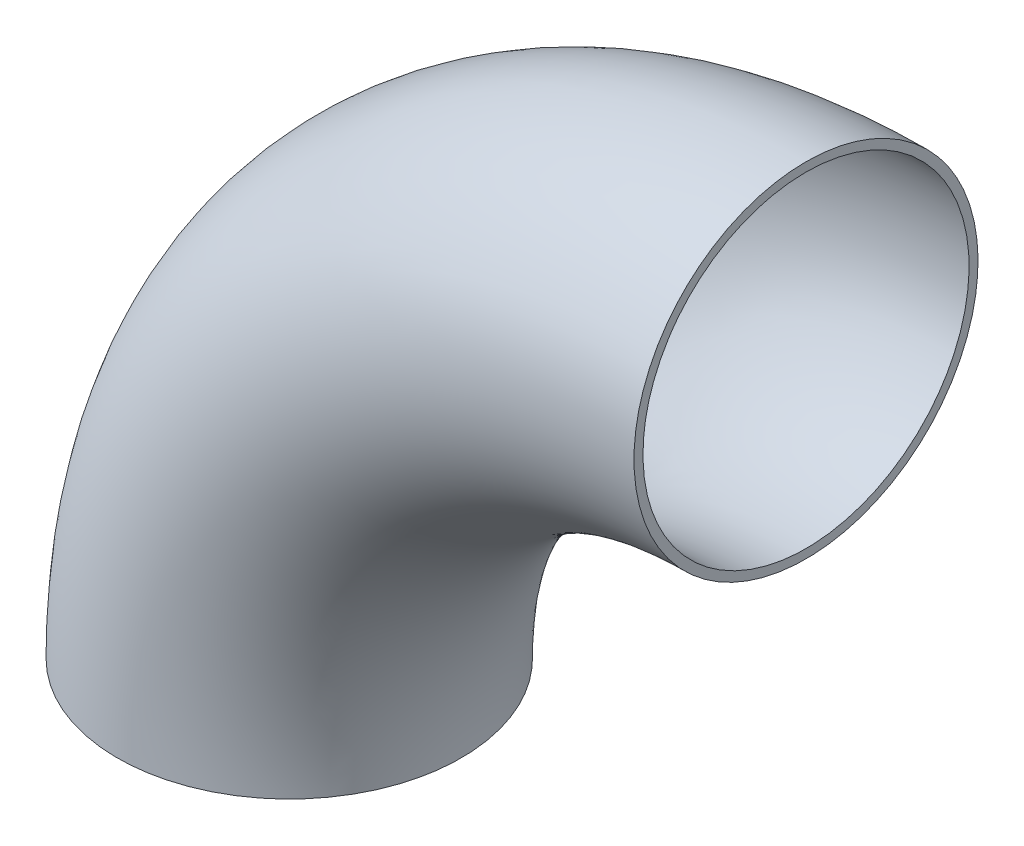
ISO-10303-21;
HEADER;
FILE_DESCRIPTION(('STEP AP214'),'2;1');
FILE_NAME('part.step','',(''),(''),'','','');
FILE_SCHEMA(('AUTOMOTIVE_DESIGN { 1 0 10303 214 1 1 1 1 }'));
ENDSEC;
DATA;
#1=APPLICATION_CONTEXT('core data for automotive mechanical design processes');
#2=APPLICATION_PROTOCOL_DEFINITION('international standard','automotive_design',2000,#1);
#3=PRODUCT_CONTEXT('',#1,'mechanical');
#4=PRODUCT('Part','Part','',(#3));
#5=PRODUCT_RELATED_PRODUCT_CATEGORY('part','',(#4));
#6=PRODUCT_DEFINITION_FORMATION('','',#4);
#7=PRODUCT_DEFINITION_CONTEXT('part definition',#1,'design');
#8=PRODUCT_DEFINITION('design','',#6,#7);
#9=PRODUCT_DEFINITION_SHAPE('','',#8);
#10=(LENGTH_UNIT() NAMED_UNIT(*) SI_UNIT(.MILLI.,.METRE.));
#11=(NAMED_UNIT(*) PLANE_ANGLE_UNIT() SI_UNIT($,.RADIAN.));
#12=(NAMED_UNIT(*) SI_UNIT($,.STERADIAN.) SOLID_ANGLE_UNIT());
#13=UNCERTAINTY_MEASURE_WITH_UNIT(LENGTH_MEASURE(1.E-05),#10,'distance_accuracy_value','');
#14=(GEOMETRIC_REPRESENTATION_CONTEXT(3) GLOBAL_UNCERTAINTY_ASSIGNED_CONTEXT((#13)) GLOBAL_UNIT_ASSIGNED_CONTEXT((#10,
#11,#12)) REPRESENTATION_CONTEXT('',''));
#15=CARTESIAN_POINT('',(0.,0.,0.));
#16=DIRECTION('',(0.,0.,1.));
#17=DIRECTION('',(1.,0.,0.));
#18=AXIS2_PLACEMENT_3D('',#15,#16,#17);
#19=CARTESIAN_POINT('',(95.377,0.,0.));
#20=DIRECTION('',(0.,0.,-1.));
#21=DIRECTION('',(-1.,0.,0.));
#22=AXIS2_PLACEMENT_3D('',#19,#20,#21);
#23=TOROIDAL_SURFACE('',#22,95.377,30.099);
#24=CARTESIAN_POINT('',(-30.099,0.,0.));
#25=CARTESIAN_POINT('',(-30.0990060673075,0.,0.845641403109949));
#26=CARTESIAN_POINT('',(-30.0633474836015,0.,1.69118323410832));
#27=CARTESIAN_POINT('',(-29.9209620799247,0.,3.37653914821918));
#28=CARTESIAN_POINT('',(-29.8142165635692,0.,4.21635166576193));
#29=CARTESIAN_POINT('',(-29.5302321212666,0.,5.8849163396915));
#30=CARTESIAN_POINT('',(-29.352915220142,0.,6.71365521027753));
#31=CARTESIAN_POINT('',(-28.929067561704,0.,8.35318543475601));
#32=CARTESIAN_POINT('',(-28.6825414016567,0.,9.163977976886));
#33=CARTESIAN_POINT('',(-28.1221515688635,0.,10.761534831184));
#34=CARTESIAN_POINT('',(-27.8083184360656,0.,11.548309856747));
#35=CARTESIAN_POINT('',(-27.1154750344904,0.,13.0926340132389));
#36=CARTESIAN_POINT('',(-26.7364637365509,0.,13.8501826824529));
#37=CARTESIAN_POINT('',(-25.9160673834376,0.,15.3304645122988));
#38=CARTESIAN_POINT('',(-25.4746982498269,0.,16.0532064970089));
#39=CARTESIAN_POINT('',(-24.5326523675352,0.,17.4589418708925));
#40=CARTESIAN_POINT('',(-24.0319758508865,0.,18.141935415561));
#41=CARTESIAN_POINT('',(-22.9748162047266,0.,19.4633927261855));
#42=CARTESIAN_POINT('',(-22.418327149911,0.,20.101851751936));
#43=CARTESIAN_POINT('',(-21.2535423683778,0.,21.3296219942096));
#44=CARTESIAN_POINT('',(-20.6452465891595,0.,21.9189331609254));
#45=CARTESIAN_POINT('',(-19.3811486487259,0.,23.0442394168817));
#46=CARTESIAN_POINT('',(-18.7253446393836,0.,23.5802324300553));
#47=CARTESIAN_POINT('',(-17.3709138613865,0.,24.5950654542918));
#48=CARTESIAN_POINT('',(-16.6722871011157,0.,25.0739054765443));
#49=CARTESIAN_POINT('',(-15.2371910511596,0.,25.9710199132504));
#50=CARTESIAN_POINT('',(-14.5007224644072,0.,26.3892954521722));
#51=CARTESIAN_POINT('',(-12.9951666757839,0.,27.1623178231562));
#52=CARTESIAN_POINT('',(-12.2260794733118,0.,27.5170646540475));
#53=CARTESIAN_POINT('',(-10.6607558153305,0.,28.1605069028242));
#54=CARTESIAN_POINT('',(-9.86451941474828,0.,28.4492024543324));
#55=CARTESIAN_POINT('',(-8.25055663788379,0.,28.9584906155634));
#56=CARTESIAN_POINT('',(-7.43283026162631,0.,29.1790832253647));
#57=CARTESIAN_POINT('',(-5.78169948703351,0.,29.5505975801853));
#58=CARTESIAN_POINT('',(-4.94829505874869,0.,29.7015191920992));
#59=CARTESIAN_POINT('',(-3.27173471578576,0.,29.9326179652855));
#60=CARTESIAN_POINT('',(-2.42857880111045,0.,30.0127951265783));
#61=CARTESIAN_POINT('',(-0.738511355559934,0.,30.1018349058816));
#62=CARTESIAN_POINT('',(0.108400168536035,0.,30.1106976525693));
#63=CARTESIAN_POINT('',(1.79995932215009,0.,30.0570459319653));
#64=CARTESIAN_POINT('',(2.64460695167093,0.,29.9945314647601));
#65=CARTESIAN_POINT('',(4.32563370356583,0.,29.798569719307));
#66=CARTESIAN_POINT('',(5.16201282284936,0.,29.6651224145474));
#67=CARTESIAN_POINT('',(6.82055608634279,0.,29.3282437068773));
#68=CARTESIAN_POINT('',(7.64272023053387,0.,29.1248123038741));
#69=CARTESIAN_POINT('',(9.26698931362081,0.,28.6494114220431));
#70=CARTESIAN_POINT('',(10.0690942313217,0.,28.3774418707999));
#71=CARTESIAN_POINT('',(11.6475414688685,0.,27.7668983414176));
#72=CARTESIAN_POINT('',(12.4238837887012,0.,27.4283243632443));
#73=CARTESIAN_POINT('',(13.9452862475613,0.,26.6869791617169));
#74=CARTESIAN_POINT('',(14.6903463967832,0.,26.2842079592843));
#75=CARTESIAN_POINT('',(16.1438878491115,0.,25.4173316935084));
#76=CARTESIAN_POINT('',(16.8523691522445,0.,24.9532266302099));
#77=CARTESIAN_POINT('',(18.2277157544082,0.,23.9669823528069));
#78=CARTESIAN_POINT('',(18.8945810702959,0.,23.4448431622099));
#79=CARTESIAN_POINT('',(20.1819549996112,0.,22.3462425726496));
#80=CARTESIAN_POINT('',(20.8024636130441,0.,21.7697811736926));
#81=CARTESIAN_POINT('',(21.9927127765104,0.,20.5666343782517));
#82=CARTESIAN_POINT('',(22.5624533195774,0.,19.9399489748762));
#83=CARTESIAN_POINT('',(23.6471157333723,0.,18.6408095964722));
#84=CARTESIAN_POINT('',(24.1620376040865,0.,17.9683556214322));
#85=CARTESIAN_POINT('',(25.1334019511084,0.,16.5824597533189));
#86=CARTESIAN_POINT('',(25.5898444197686,0.,15.8690178548855));
#87=CARTESIAN_POINT('',(26.4410048508892,0.,14.4062183650698));
#88=CARTESIAN_POINT('',(26.8357228133475,0.,13.6568607736863));
#89=CARTESIAN_POINT('',(27.5606280079282,0.,12.127557414993));
#90=CARTESIAN_POINT('',(27.890815242817,0.,11.3476116489946));
#91=CARTESIAN_POINT('',(28.4843115698094,0.,9.76267685827808));
#92=CARTESIAN_POINT('',(28.7476206619183,0.,8.95768783356196));
#93=CARTESIAN_POINT('',(29.2054887230813,0.,7.32838955205376));
#94=CARTESIAN_POINT('',(29.4000476952347,0.,6.50408029613263));
#95=CARTESIAN_POINT('',(29.7190323353591,0.,4.84200186187454));
#96=CARTESIAN_POINT('',(29.843458003332,0.,4.00423268353794));
#97=CARTESIAN_POINT('',(30.0212914431871,0.,2.3211904410831));
#98=CARTESIAN_POINT('',(30.0746992150693,0.,1.47591737696485));
#99=CARTESIAN_POINT('',(30.1101171655049,0.,-0.216123252289674));
#100=CARTESIAN_POINT('',(30.0921273440565,0.,-1.06289081742599));
#101=CARTESIAN_POINT('',(29.9848780022466,0.,-2.75190047703131));
#102=CARTESIAN_POINT('',(29.8956184786723,0.,-3.59414257129632));
#103=CARTESIAN_POINT('',(29.646464310356,0.,-5.26811341375078));
#104=CARTESIAN_POINT('',(29.4865696656083,0.,-6.09984216193942));
#105=CARTESIAN_POINT('',(29.0972820017657,0.,-7.74687325418405));
#106=CARTESIAN_POINT('',(28.8678889796913,0.,-8.56217559753582));
#107=CARTESIAN_POINT('',(28.3412354107381,0.,-10.170557531412));
#108=CARTESIAN_POINT('',(28.0439748638616,0.,-10.9636371219371));
#109=CARTESIAN_POINT('',(27.3836996332088,0.,-12.5219351267184));
#110=CARTESIAN_POINT('',(27.0206849580313,0.,-13.2871535446179));
#111=CARTESIAN_POINT('',(26.2314822613451,0.,-14.784289069533));
#112=CARTESIAN_POINT('',(25.8052942398522,0.,-15.5162061765569));
#113=CARTESIAN_POINT('',(24.8927748542436,0.,-16.9415354905753));
#114=CARTESIAN_POINT('',(24.4064434983807,0.,-17.6349477028535));
#115=CARTESIAN_POINT('',(23.377094921048,0.,-18.9783375925005));
#116=CARTESIAN_POINT('',(22.8340776995715,0.,-19.6283152698643));
#117=CARTESIAN_POINT('',(21.6952176856094,0.,-20.8802153934332));
#118=CARTESIAN_POINT('',(21.099374871726,0.,-21.4821378201726));
#119=CARTESIAN_POINT('',(19.859099947806,0.,-22.6336478404926));
#120=CARTESIAN_POINT('',(19.2146678377339,0.,-23.1832354340349));
#121=CARTESIAN_POINT('',(17.8817956323948,0.,-24.2261687175616));
#122=CARTESIAN_POINT('',(17.1933555227861,0.,-24.7195143892171));
#123=CARTESIAN_POINT('',(15.7773619091106,0.,-25.6464562261302));
#124=CARTESIAN_POINT('',(15.0498084050638,0.,-26.0800523914183));
#125=CARTESIAN_POINT('',(13.5607612648254,0.,-26.8844121783705));
#126=CARTESIAN_POINT('',(12.7992676644949,0.,-27.2551758664212));
#127=CARTESIAN_POINT('',(11.2477533743134,0.,-27.9312353519132));
#128=CARTESIAN_POINT('',(10.4577326845003,0.,-28.2365311494411));
#129=CARTESIAN_POINT('',(8.85478108230442,0.,-28.7794842848821));
#130=CARTESIAN_POINT('',(8.04185017848473,0.,-29.0171416480754));
#131=CARTESIAN_POINT('',(6.39885730612533,0.,-29.4231284688904));
#132=CARTESIAN_POINT('',(5.56879533756484,0.,-29.591457926428));
#133=CARTESIAN_POINT('',(3.89744005970245,0.,-29.8575924562613));
#134=CARTESIAN_POINT('',(3.05614673013778,0.,-29.9553974013045));
#135=CARTESIAN_POINT('',(1.3683113010784,0.,-30.0797870752173));
#136=CARTESIAN_POINT('',(0.521769201582193,0.,-30.1063718040666));
#137=CARTESIAN_POINT('',(-1.17054373119136,0.,-30.0881320614005));
#138=CARTESIAN_POINT('',(-2.01631456593911,0.,-30.0433077263104));
#139=CARTESIAN_POINT('',(-3.70107367899994,0.,-29.8825687850652));
#140=CARTESIAN_POINT('',(-4.54006195730522,0.,-29.766654178828));
#141=CARTESIAN_POINT('',(-6.20529295167341,0.,-29.4645584702482));
#142=CARTESIAN_POINT('',(-7.03153564194813,0.,-29.2783772257543));
#143=CARTESIAN_POINT('',(-8.66539960049622,0.,-28.8370719077981));
#144=CARTESIAN_POINT('',(-9.47302086911284,0.,-28.5819478356067));
#145=CARTESIAN_POINT('',(-11.0639150721224,0.,-28.0045652761397));
#146=CARTESIAN_POINT('',(-11.8471875541082,0.,-27.6823055423206));
#147=CARTESIAN_POINT('',(-13.3837998336846,0.,-26.9729456183597));
#148=CARTESIAN_POINT('',(-14.1371396254149,0.,-26.5858454155232));
#149=CARTESIAN_POINT('',(-15.6085016875954,0.,-25.7495730587645));
#150=CARTESIAN_POINT('',(-16.3265253314832,0.,-25.3004033213057));
#151=CARTESIAN_POINT('',(-17.7221813049172,0.,-24.343174112118));
#152=CARTESIAN_POINT('',(-18.3998136753953,0.,-23.8351147000687));
#153=CARTESIAN_POINT('',(-19.7098008386784,0.,-22.7637746171326));
#154=CARTESIAN_POINT('',(-20.3421604352849,0.,-22.200499820109));
#155=CARTESIAN_POINT('',(-21.5571891333155,0.,-21.0226850432053));
#156=CARTESIAN_POINT('',(-22.1398580403279,0.,-20.4081448627713));
#157=CARTESIAN_POINT('',(-23.2515030189349,0.,-19.1320061894637));
#158=CARTESIAN_POINT('',(-23.7804653647006,0.,-18.4703957399122));
#159=CARTESIAN_POINT('',(-24.7807582992621,0.,-17.104971584385));
#160=CARTESIAN_POINT('',(-25.2520897979998,0.,-16.4011585450137));
#161=CARTESIAN_POINT('',(-26.1339791782193,0.,-14.9559956516108));
#162=CARTESIAN_POINT('',(-26.5445094331447,0.,-14.214628938201));
#163=CARTESIAN_POINT('',(-27.3016438464908,0.,-12.699883522407));
#164=CARTESIAN_POINT('',(-27.6482437574939,0.,-11.9265026972391));
#165=CARTESIAN_POINT('',(-28.2746713865608,0.,-10.3541338918702));
#166=CARTESIAN_POINT('',(-28.5545725813213,0.,-9.55517520016262));
#167=CARTESIAN_POINT('',(-29.0460372197583,0.,-7.93679308534095));
#168=CARTESIAN_POINT('',(-29.2576186197704,0.,-7.11737510059269));
#169=CARTESIAN_POINT('',(-29.6550477394174,0.,-5.25764208937957));
#170=CARTESIAN_POINT('',(-29.8213885524104,0.,-4.21310126415564));
#171=CARTESIAN_POINT('',(-30.0433608941087,0.,-2.1123218604654));
#172=CARTESIAN_POINT('',(-30.0989924228142,0.,-1.05608328199909));
#173=CARTESIAN_POINT('',(-30.099,0.,0.));
#174=B_SPLINE_CURVE_WITH_KNOTS('',3,(#24,#25,#26,#27,#28,#29,#30,#31,#32,#33,#34,#35,#36,#37,
#38,#39,#40,#41,#42,#43,#44,#45,#46,#47,#48,#49,#50,#51,#52,#53,#54,#55,#56,#57,#58,#59,#60,#61,
#62,#63,#64,#65,#66,#67,#68,#69,#70,#71,#72,#73,#74,#75,#76,#77,#78,#79,#80,#81,#82,#83,#84,#85,
#86,#87,#88,#89,#90,#91,#92,#93,#94,#95,#96,#97,#98,#99,#100,#101,#102,#103,#104,#105,#106,#107,
#108,#109,#110,#111,#112,#113,#114,#115,#116,#117,#118,#119,#120,#121,#122,#123,#124,#125,#126,
#127,#128,#129,#130,#131,#132,#133,#134,#135,#136,#137,#138,#139,#140,#141,#142,#143,#144,#145,
#146,#147,#148,#149,#150,#151,#152,#153,#154,#155,#156,#157,#158,#159,#160,#161,#162,#163,#164,
#165,#166,#167,#168,#169,#170,#171,#172,#173),.UNSPECIFIED.,.T.,.F.,(4,2,2,2,2,2,2,2,2,2,2,2,2,
2,2,2,2,2,2,2,2,2,2,2,2,2,2,2,2,2,2,2,2,2,2,2,2,2,2,2,2,2,2,2,2,2,2,2,2,2,2,2,2,2,2,2,2,2,2,2,2,
2,2,2,2,2,2,2,2,2,2,2,2,2,4),(0.,2.53600171906748,5.0726706887443,7.61215027056905,
10.1514612058472,12.6896223795649,15.2278236344886,17.7653779884657,20.3029224149216,
22.8407365239833,25.3785532048806,27.9164686629465,30.4543836241329,32.9922514591795,
35.5301193410068,38.0679820886402,40.6058448333476,43.1437124265841,45.6815800190945,
48.219443032368,50.7573060425623,53.295170001301,55.8330339633984,58.3709006069371,
60.9087672517771,63.4466330695461,65.9844988854591,68.5223636733731,71.0602284609918,
73.5980935968533,76.1359587333513,78.6738242017343,81.2116896702066,83.7495550298779,
86.287420389351,88.8252856344202,91.3631508794213,93.9010161244224,96.4388813694915,
98.9767467289647,101.514612088636,104.052477557108,106.590343025491,109.128208161989,
111.666073297851,114.20393808547,116.741802873383,119.279668689296,121.817534507065,
124.355401151905,126.893267795444,129.431131757542,131.96899571628,134.506858726475,
137.044721739748,139.582589332258,142.120456925495,144.658319670202,147.196182417836,
149.734050299663,152.27191813471,154.809833095896,157.347748553962,159.885565234859,
162.423379343921,164.960923770377,167.498478124354,170.036679379278,172.574840552995,
175.114151488273,177.653631070098,180.190300039775,182.726301758843,185.893399548495,
189.060497338147),.UNSPECIFIED.);
#175=CARTESIAN_POINT('',(-30.099,0.,0.));
#176=VERTEX_POINT('',#175);
#177=EDGE_CURVE('E30',#176,#176,#174,.T.);
#178=ORIENTED_EDGE('',*,*,#177,.F.);
#179=EDGE_LOOP('',(#178));
#180=FACE_BOUND('',#179,.T.);
#181=CARTESIAN_POINT('',(95.377,125.476,0.));
#182=CARTESIAN_POINT('',(95.377,125.476006067308,0.845641403109949));
#183=CARTESIAN_POINT('',(95.377,125.440347483602,1.69118323410832));
#184=CARTESIAN_POINT('',(95.377,125.297962079925,3.37653914821918));
#185=CARTESIAN_POINT('',(95.377,125.191216563569,4.21635166576192));
#186=CARTESIAN_POINT('',(95.377,124.907232121267,5.8849163396915));
#187=CARTESIAN_POINT('',(95.377,124.729915220142,6.71365521027753));
#188=CARTESIAN_POINT('',(95.377,124.306067561704,8.353185434756));
#189=CARTESIAN_POINT('',(95.377,124.059541401657,9.16397797688599));
#190=CARTESIAN_POINT('',(95.377,123.499151568864,10.761534831184));
#191=CARTESIAN_POINT('',(95.377,123.185318436066,11.548309856747));
#192=CARTESIAN_POINT('',(95.377,122.49247503449,13.0926340132389));
#193=CARTESIAN_POINT('',(95.377,122.113463736551,13.8501826824529));
#194=CARTESIAN_POINT('',(95.377,121.293067383438,15.3304645122988));
#195=CARTESIAN_POINT('',(95.377,120.851698249827,16.0532064970089));
#196=CARTESIAN_POINT('',(95.377,119.909652367535,17.4589418708925));
#197=CARTESIAN_POINT('',(95.377,119.408975850887,18.141935415561));
#198=CARTESIAN_POINT('',(95.377,118.351816204727,19.4633927261855));
#199=CARTESIAN_POINT('',(95.377,117.795327149911,20.101851751936));
#200=CARTESIAN_POINT('',(95.377,116.630542368378,21.3296219942096));
#201=CARTESIAN_POINT('',(95.377,116.02224658916,21.9189331609254));
#202=CARTESIAN_POINT('',(95.377,114.758148648726,23.0442394168816));
#203=CARTESIAN_POINT('',(95.377,114.102344639384,23.5802324300553));
#204=CARTESIAN_POINT('',(95.377,112.747913861387,24.5950654542918));
#205=CARTESIAN_POINT('',(95.377,112.049287101116,25.0739054765443));
#206=CARTESIAN_POINT('',(95.377,110.61419105116,25.9710199132504));
#207=CARTESIAN_POINT('',(95.377,109.877722464407,26.3892954521722));
#208=CARTESIAN_POINT('',(95.377,108.372166675784,27.1623178231562));
#209=CARTESIAN_POINT('',(95.377,107.603079473312,27.5170646540475));
#210=CARTESIAN_POINT('',(95.377,106.037755815331,28.1605069028242));
#211=CARTESIAN_POINT('',(95.377,105.241519414748,28.4492024543324));
#212=CARTESIAN_POINT('',(95.377,103.627556637884,28.9584906155634));
#213=CARTESIAN_POINT('',(95.377,102.809830261626,29.1790832253647));
#214=CARTESIAN_POINT('',(95.377,101.158699487034,29.5505975801853));
#215=CARTESIAN_POINT('',(95.377,100.325295058749,29.7015191920992));
#216=CARTESIAN_POINT('',(95.377,98.6487347157857,29.9326179652855));
#217=CARTESIAN_POINT('',(95.377,97.8055788011104,30.0127951265783));
#218=CARTESIAN_POINT('',(95.377,96.1155113555599,30.1018349058816));
#219=CARTESIAN_POINT('',(95.377,95.268599831464,30.1106976525693));
#220=CARTESIAN_POINT('',(95.377,93.5770406778499,30.0570459319653));
#221=CARTESIAN_POINT('',(95.377,92.7323930483291,29.9945314647601));
#222=CARTESIAN_POINT('',(95.377,91.0513662964342,29.798569719307));
#223=CARTESIAN_POINT('',(95.377,90.2149871771506,29.6651224145474));
#224=CARTESIAN_POINT('',(95.377,88.5564439136572,29.3282437068773));
#225=CARTESIAN_POINT('',(95.377,87.7342797694661,29.1248123038741));
#226=CARTESIAN_POINT('',(95.377,86.1100106863792,28.6494114220431));
#227=CARTESIAN_POINT('',(95.377,85.3079057686783,28.3774418707999));
#228=CARTESIAN_POINT('',(95.377,83.7294585311315,27.7668983414176));
#229=CARTESIAN_POINT('',(95.377,82.9531162112988,27.4283243632443));
#230=CARTESIAN_POINT('',(95.377,81.4317137524387,26.6869791617169));
#231=CARTESIAN_POINT('',(95.377,80.6866536032168,26.2842079592843));
#232=CARTESIAN_POINT('',(95.377,79.2331121508885,25.4173316935084));
#233=CARTESIAN_POINT('',(95.377,78.5246308477555,24.9532266302099));
#234=CARTESIAN_POINT('',(95.377,77.1492842455918,23.9669823528069));
#235=CARTESIAN_POINT('',(95.377,76.4824189297041,23.4448431622099));
#236=CARTESIAN_POINT('',(95.377,75.1950450003889,22.3462425726496));
#237=CARTESIAN_POINT('',(95.377,74.5745363869559,21.7697811736926));
#238=CARTESIAN_POINT('',(95.377,73.3842872234896,20.5666343782518));
#239=CARTESIAN_POINT('',(95.377,72.8145466804226,19.9399489748762));
#240=CARTESIAN_POINT('',(95.377,71.7298842666277,18.6408095964722));
#241=CARTESIAN_POINT('',(95.377,71.2149623959135,17.9683556214322));
#242=CARTESIAN_POINT('',(95.377,70.2435980488916,16.5824597533189));
#243=CARTESIAN_POINT('',(95.377,69.7871555802315,15.8690178548855));
#244=CARTESIAN_POINT('',(95.377,68.9359951491108,14.4062183650698));
#245=CARTESIAN_POINT('',(95.377,68.5412771866525,13.6568607736863));
#246=CARTESIAN_POINT('',(95.377,67.8163719920718,12.127557414993));
#247=CARTESIAN_POINT('',(95.377,67.486184757183,11.3476116489946));
#248=CARTESIAN_POINT('',(95.377,66.8926884301906,9.76267685827809));
#249=CARTESIAN_POINT('',(95.377,66.6293793380817,8.95768783356196));
#250=CARTESIAN_POINT('',(95.377,66.1715112769187,7.32838955205377));
#251=CARTESIAN_POINT('',(95.377,65.9769523047653,6.50408029613263));
#252=CARTESIAN_POINT('',(95.377,65.6579676646409,4.84200186187455));
#253=CARTESIAN_POINT('',(95.377,65.533541996668,4.00423268353796));
#254=CARTESIAN_POINT('',(95.377,65.3557085568129,2.32119044108311));
#255=CARTESIAN_POINT('',(95.377,65.3023007849307,1.47591737696486));
#256=CARTESIAN_POINT('',(95.377,65.2668828344951,-0.216123252289665));
#257=CARTESIAN_POINT('',(95.377,65.2848726559435,-1.06289081742598));
#258=CARTESIAN_POINT('',(95.377,65.3921219977534,-2.7519004770313));
#259=CARTESIAN_POINT('',(95.377,65.4813815213277,-3.59414257129631));
#260=CARTESIAN_POINT('',(95.377,65.730535689644,-5.26811341375078));
#261=CARTESIAN_POINT('',(95.377,65.8904303343917,-6.09984216193942));
#262=CARTESIAN_POINT('',(95.377,66.2797179982342,-7.74687325418405));
#263=CARTESIAN_POINT('',(95.377,66.5091110203087,-8.56217559753582));
#264=CARTESIAN_POINT('',(95.377,67.0357645892619,-10.170557531412));
#265=CARTESIAN_POINT('',(95.377,67.3330251361384,-10.9636371219371));
#266=CARTESIAN_POINT('',(95.377,67.9933003667912,-12.5219351267184));
#267=CARTESIAN_POINT('',(95.377,68.3563150419687,-13.2871535446179));
#268=CARTESIAN_POINT('',(95.377,69.1455177386549,-14.784289069533));
#269=CARTESIAN_POINT('',(95.377,69.5717057601478,-15.5162061765568));
#270=CARTESIAN_POINT('',(95.377,70.4842251457564,-16.9415354905753));
#271=CARTESIAN_POINT('',(95.377,70.9705565016193,-17.6349477028535));
#272=CARTESIAN_POINT('',(95.377,71.999905078952,-18.9783375925005));
#273=CARTESIAN_POINT('',(95.377,72.5429223004285,-19.6283152698643));
#274=CARTESIAN_POINT('',(95.377,73.6817823143906,-20.8802153934331));
#275=CARTESIAN_POINT('',(95.377,74.277625128274,-21.4821378201726));
#276=CARTESIAN_POINT('',(95.377,75.5179000521939,-22.6336478404926));
#277=CARTESIAN_POINT('',(95.377,76.1623321622661,-23.1832354340349));
#278=CARTESIAN_POINT('',(95.377,77.4952043676052,-24.2261687175616));
#279=CARTESIAN_POINT('',(95.377,78.1836444772139,-24.7195143892171));
#280=CARTESIAN_POINT('',(95.377,79.5996380908894,-25.6464562261302));
#281=CARTESIAN_POINT('',(95.377,80.3271915949363,-26.0800523914183));
#282=CARTESIAN_POINT('',(95.377,81.8162387351746,-26.8844121783705));
#283=CARTESIAN_POINT('',(95.377,82.5777323355051,-27.2551758664212));
#284=CARTESIAN_POINT('',(95.377,84.1292466256866,-27.9312353519132));
#285=CARTESIAN_POINT('',(95.377,84.9192673154997,-28.2365311494411));
#286=CARTESIAN_POINT('',(95.377,86.5222189176956,-28.7794842848821));
#287=CARTESIAN_POINT('',(95.377,87.3351498215153,-29.0171416480754));
#288=CARTESIAN_POINT('',(95.377,88.9781426938747,-29.4231284688904));
#289=CARTESIAN_POINT('',(95.377,89.8082046624352,-29.591457926428));
#290=CARTESIAN_POINT('',(95.377,91.4795599402976,-29.8575924562613));
#291=CARTESIAN_POINT('',(95.377,92.3208532698622,-29.9553974013045));
#292=CARTESIAN_POINT('',(95.377,94.0086886989216,-30.0797870752173));
#293=CARTESIAN_POINT('',(95.377,94.8552307984178,-30.1063718040666));
#294=CARTESIAN_POINT('',(95.377,96.5475437311914,-30.0881320614005));
#295=CARTESIAN_POINT('',(95.377,97.3933145659391,-30.0433077263104));
#296=CARTESIAN_POINT('',(95.377,99.078073679,-29.8825687850652));
#297=CARTESIAN_POINT('',(95.377,99.9170619573052,-29.766654178828));
#298=CARTESIAN_POINT('',(95.377,101.582292951673,-29.4645584702482));
#299=CARTESIAN_POINT('',(95.377,102.408535641948,-29.2783772257543));
#300=CARTESIAN_POINT('',(95.377,104.042399600496,-28.8370719077981));
#301=CARTESIAN_POINT('',(95.377,104.850020869113,-28.5819478356067));
#302=CARTESIAN_POINT('',(95.377,106.440915072122,-28.0045652761397));
#303=CARTESIAN_POINT('',(95.377,107.224187554108,-27.6823055423206));
#304=CARTESIAN_POINT('',(95.377,108.760799833685,-26.9729456183597));
#305=CARTESIAN_POINT('',(95.377,109.514139625415,-26.5858454155232));
#306=CARTESIAN_POINT('',(95.377,110.985501687595,-25.7495730587645));
#307=CARTESIAN_POINT('',(95.377,111.703525331483,-25.3004033213057));
#308=CARTESIAN_POINT('',(95.377,113.099181304917,-24.3431741121181));
#309=CARTESIAN_POINT('',(95.377,113.776813675395,-23.8351147000688));
#310=CARTESIAN_POINT('',(95.377,115.086800838678,-22.7637746171326));
#311=CARTESIAN_POINT('',(95.377,115.719160435285,-22.200499820109));
#312=CARTESIAN_POINT('',(95.377,116.934189133315,-21.0226850432053));
#313=CARTESIAN_POINT('',(95.377,117.516858040328,-20.4081448627713));
#314=CARTESIAN_POINT('',(95.377,118.628503018935,-19.1320061894637));
#315=CARTESIAN_POINT('',(95.377,119.157465364701,-18.4703957399122));
#316=CARTESIAN_POINT('',(95.377,120.157758299262,-17.104971584385));
#317=CARTESIAN_POINT('',(95.377,120.629089798,-16.4011585450137));
#318=CARTESIAN_POINT('',(95.377,121.510979178219,-14.9559956516109));
#319=CARTESIAN_POINT('',(95.377,121.921509433145,-14.214628938201));
#320=CARTESIAN_POINT('',(95.377,122.678643846491,-12.699883522407));
#321=CARTESIAN_POINT('',(95.377,123.025243757494,-11.9265026972392));
#322=CARTESIAN_POINT('',(95.377,123.651671386561,-10.3541338918703));
#323=CARTESIAN_POINT('',(95.377,123.931572581321,-9.55517520016265));
#324=CARTESIAN_POINT('',(95.377,124.423037219758,-7.93679308534098));
#325=CARTESIAN_POINT('',(95.377,124.63461861977,-7.11737510059271));
#326=CARTESIAN_POINT('',(95.377,125.032047739417,-5.2576420893796));
#327=CARTESIAN_POINT('',(95.377,125.19838855241,-4.21310126415566));
#328=CARTESIAN_POINT('',(95.377,125.420360894109,-2.11232186046541));
#329=CARTESIAN_POINT('',(95.377,125.475992422814,-1.05608328199909));
#330=CARTESIAN_POINT('',(95.377,125.476,0.));
#331=B_SPLINE_CURVE_WITH_KNOTS('',3,(#181,#182,#183,#184,#185,#186,#187,#188,#189,#190,#191,
#192,#193,#194,#195,#196,#197,#198,#199,#200,#201,#202,#203,#204,#205,#206,#207,#208,#209,#210,
#211,#212,#213,#214,#215,#216,#217,#218,#219,#220,#221,#222,#223,#224,#225,#226,#227,#228,#229,
#230,#231,#232,#233,#234,#235,#236,#237,#238,#239,#240,#241,#242,#243,#244,#245,#246,#247,#248,
#249,#250,#251,#252,#253,#254,#255,#256,#257,#258,#259,#260,#261,#262,#263,#264,#265,#266,#267,
#268,#269,#270,#271,#272,#273,#274,#275,#276,#277,#278,#279,#280,#281,#282,#283,#284,#285,#286,
#287,#288,#289,#290,#291,#292,#293,#294,#295,#296,#297,#298,#299,#300,#301,#302,#303,#304,#305,
#306,#307,#308,#309,#310,#311,#312,#313,#314,#315,#316,#317,#318,#319,#320,#321,#322,#323,#324,
#325,#326,#327,#328,#329,#330),.UNSPECIFIED.,.T.,.F.,(4,2,2,2,2,2,2,2,2,2,2,2,2,2,2,2,2,2,2,2,2,
2,2,2,2,2,2,2,2,2,2,2,2,2,2,2,2,2,2,2,2,2,2,2,2,2,2,2,2,2,2,2,2,2,2,2,2,2,2,2,2,2,2,2,2,2,2,2,2,
2,2,2,2,2,4),(0.,2.53600171906748,5.0726706887443,7.61215027056905,10.1514612058472,
12.6896223795649,15.2278236344886,17.7653779884657,20.3029224149216,22.8407365239833,
25.3785532048806,27.9164686629465,30.4543836241329,32.9922514591795,35.5301193410067,
38.0679820886402,40.6058448333476,43.1437124265841,45.6815800190946,48.219443032368,
50.7573060425623,53.295170001301,55.8330339633984,58.3709006069371,60.9087672517771,
63.446633069546,65.9844988854591,68.522363673373,71.0602284609918,73.5980935968533,
76.1359587333513,78.6738242017343,81.2116896702066,83.7495550298779,86.287420389351,
88.8252856344202,91.3631508794213,93.9010161244224,96.4388813694915,98.9767467289647,
101.514612088636,104.052477557108,106.590343025491,109.128208161989,111.666073297851,
114.20393808547,116.741802873383,119.279668689296,121.817534507065,124.355401151905,
126.893267795444,129.431131757542,131.96899571628,134.506858726475,137.044721739748,
139.582589332258,142.120456925495,144.658319670202,147.196182417836,149.734050299663,
152.27191813471,154.809833095896,157.347748553962,159.885565234859,162.423379343921,
164.960923770377,167.498478124354,170.036679379278,172.574840552995,175.114151488274,
177.653631070098,180.190300039775,182.726301758843,185.893399548495,189.060497338148),.UNSPECIFIED.);
#332=CARTESIAN_POINT('',(95.377,125.476,0.));
#333=VERTEX_POINT('',#332);
#334=EDGE_CURVE('E19',#333,#333,#331,.T.);
#335=ORIENTED_EDGE('',*,*,#334,.T.);
#336=EDGE_LOOP('',(#335));
#337=FACE_BOUND('',#336,.T.);
#338=ADVANCED_FACE('F14',(#180,#337),#23,.F.);
#339=CARTESIAN_POINT('',(95.377,95.377,0.));
#340=DIRECTION('',(-1.,0.,0.));
#341=DIRECTION('',(0.,0.,1.));
#342=AXIS2_PLACEMENT_3D('',#339,#340,#341);
#343=PLANE('',#342);
#344=ORIENTED_EDGE('',*,*,#334,.F.);
#345=EDGE_LOOP('',(#344));
#346=FACE_BOUND('',#345,.T.);
#347=CARTESIAN_POINT('',(95.377,127.127,0.));
#348=CARTESIAN_POINT('',(95.377,127.127006400113,-0.892026796529478));
#349=CARTESIAN_POINT('',(95.377,127.089391860339,-1.78394855918599));
#350=CARTESIAN_POINT('',(95.377,126.93919628684,-3.56175015634934));
#351=CARTESIAN_POINT('',(95.377,126.826595531191,-4.44762833941131));
#352=CARTESIAN_POINT('',(95.377,126.527033883193,-6.20771765790243));
#353=CARTESIAN_POINT('',(95.377,126.339990738546,-7.08191477877377));
#354=CARTESIAN_POINT('',(95.377,125.89289405243,-8.81137704088187));
#355=CARTESIAN_POINT('',(95.3769999999999,125.632845360397,-9.66664343553375));
#356=CARTESIAN_POINT('',(95.3769999999999,125.041716844793,-11.3518299907004));
#357=CARTESIAN_POINT('',(95.377,124.710669236356,-12.1817614522647));
#358=CARTESIAN_POINT('',(95.377,123.97982176634,-13.8107953726149));
#359=CARTESIAN_POINT('',(95.377,123.580020819146,-14.6098973443596));
#360=CARTESIAN_POINT('',(95.377,122.714623822192,-16.1713760678257));
#361=CARTESIAN_POINT('',(95.377,122.249044567328,-16.9337621276465));
#362=CARTESIAN_POINT('',(95.377,121.25532528221,-18.4166053490427));
#363=CARTESIAN_POINT('',(95.377,120.727185496716,-19.1370626746424));
#364=CARTESIAN_POINT('',(95.377,119.61203819064,-20.5310049854278));
#365=CARTESIAN_POINT('',(95.377,119.025024419737,-21.2044849703966));
#366=CARTESIAN_POINT('',(95.377,117.79634848985,-22.4996012597148));
#367=CARTESIAN_POINT('',(95.377,117.154686275485,-23.1212375115247));
#368=CARTESIAN_POINT('',(95.377,115.821249629458,-24.3082694270903));
#369=CARTESIAN_POINT('',(95.377,115.129473248295,-24.8736629009022));
#370=CARTESIAN_POINT('',(95.377,113.700748798931,-25.9441618716159));
#371=CARTESIAN_POINT('',(95.377,112.963800739574,-26.449267380321));
#372=CARTESIAN_POINT('',(95.377,111.449986340886,-27.3955906257916));
#373=CARTESIAN_POINT('',(95.377,110.673120743046,-27.8368095487048));
#374=CARTESIAN_POINT('',(95.377,109.08498172551,-28.6522339906711));
#375=CARTESIAN_POINT('',(95.377,108.273708305181,-29.0264395084889));
#376=CARTESIAN_POINT('',(95.377,106.622523011952,-29.7051760578314));
#377=CARTESIAN_POINT('',(95.377,105.782611196992,-30.0097072303084));
#378=CARTESIAN_POINT('',(95.377,104.080118816333,-30.5469310290753));
#379=CARTESIAN_POINT('',(95.377,103.217538250661,-30.779623655448));
#380=CARTESIAN_POINT('',(95.377,101.475839121343,-31.1715164347946));
#381=CARTESIAN_POINT('',(95.377,100.596720526106,-31.330716447362));
#382=CARTESIAN_POINT('',(95.377,98.8281969575799,-31.5744915245628));
#383=CARTESIAN_POINT('',(95.377,97.9387919842937,-31.6590665892176));
#384=CARTESIAN_POINT('',(95.377,96.1560204172573,-31.7529904070481));
#385=CARTESIAN_POINT('',(95.377,95.2626538306582,-31.7623392959592));
#386=CARTESIAN_POINT('',(95.377,93.4783087319092,-31.7057446539718));
#387=CARTESIAN_POINT('',(95.377,92.5873302197564,-31.6398011231647));
#388=CARTESIAN_POINT('',(95.377,90.8140952494032,-31.4330904212099));
#389=CARTESIAN_POINT('',(95.377,89.9318387944627,-31.2923232220964));
#390=CARTESIAN_POINT('',(95.377,88.1823205840266,-30.9369659355246));
#391=CARTESIAN_POINT('',(95.377,87.3150588285508,-30.7223758479684));
#392=CARTESIAN_POINT('',(95.377,85.6016948168557,-30.220898124518));
#393=CARTESIAN_POINT('',(95.377,84.755592582994,-29.9340104122362));
#394=CARTESIAN_POINT('',(95.377,83.0905638514045,-29.2899771533941));
#395=CARTESIAN_POINT('',(95.377,82.2716373536907,-28.9328316067978));
#396=CARTESIAN_POINT('',(95.377,80.6667824392814,-28.1508219005453));
#397=CARTESIAN_POINT('',(95.377,79.8808540118321,-27.7259577629581));
#398=CARTESIAN_POINT('',(95.377,78.3475824376461,-26.8115313222662));
#399=CARTESIAN_POINT('',(95.377,77.6002392908813,-26.3219690192088));
#400=CARTESIAN_POINT('',(95.377,76.1494517358563,-25.2816269544376));
#401=CARTESIAN_POINT('',(95.377,75.4460073098145,-24.730847217521));
#402=CARTESIAN_POINT('',(95.377,74.0880179328996,-23.5719858361283));
#403=CARTESIAN_POINT('',(95.377,73.433472982021,-22.9639041916589));
#404=CARTESIAN_POINT('',(95.377,72.177935889757,-21.6947620023753));
#405=CARTESIAN_POINT('',(95.377,71.57694375572,-21.0337014502914));
#406=CARTESIAN_POINT('',(95.377,70.4327850913794,-19.6633012621014));
#407=CARTESIAN_POINT('',(95.377,69.8896185610902,-18.9539616259833));
#408=CARTESIAN_POINT('',(95.377,68.8649726254131,-17.4920461532899));
#409=CARTESIAN_POINT('',(95.377,68.3834932280923,-16.7394703110606));
#410=CARTESIAN_POINT('',(95.377,67.4856446720578,-15.1964328745462));
#411=CARTESIAN_POINT('',(95.377,67.0692755133465,-14.4059712802598));
#412=CARTESIAN_POINT('',(95.377,66.3046075865737,-12.792782083326));
#413=CARTESIAN_POINT('',(95.377,65.9563088155939,-11.9700544820618));
#414=CARTESIAN_POINT('',(95.377,65.3302578377538,-10.2981823399558));
#415=CARTESIAN_POINT('',(95.377,65.0525056308879,-9.44903779911599));
#416=CARTESIAN_POINT('',(95.377,64.569522444007,-7.73036872579512));
#417=CARTESIAN_POINT('',(95.377,64.3642914607229,-6.86084419423274));
#418=CARTESIAN_POINT('',(95.377,64.027809772828,-5.10759690071155));
#419=CARTESIAN_POINT('',(95.377,63.8965590682152,-4.22387413875311));
#420=CARTESIAN_POINT('',(95.377,63.7089710514904,-2.44851312350539));
#421=CARTESIAN_POINT('',(95.377,63.6526337393784,-1.55687487021609));
#422=CARTESIAN_POINT('',(95.377,63.6152730321678,0.227978114229609));
#423=CARTESIAN_POINT('',(95.377,63.6342496370712,1.12119284538606));
#424=CARTESIAN_POINT('',(95.377,63.7473818541703,2.9028486044634));
#425=CARTESIAN_POINT('',(95.377,63.8415374697549,3.7912896321691));
#426=CARTESIAN_POINT('',(95.377,64.1043583224093,5.55708166007466));
#427=CARTESIAN_POINT('',(95.377,64.2730235594849,6.43443266027364));
#428=CARTESIAN_POINT('',(95.377,64.6836645550994,8.17180723015194));
#429=CARTESIAN_POINT('',(95.377,64.9256403167813,9.03183079908841));
#430=CARTESIAN_POINT('',(95.377,65.4811820561835,10.7284362145696));
#431=CARTESIAN_POINT('',(95.377,65.7947480339013,11.5650180611151));
#432=CARTESIAN_POINT('',(95.377,66.4912408932397,13.208792327762));
#433=CARTESIAN_POINT('',(95.377,66.8741677657897,14.0159847517067));
#434=CARTESIAN_POINT('',(95.377,67.7066600618722,15.5952416345285));
#435=CARTESIAN_POINT('',(95.377,68.1562254853879,16.3673060934144));
#436=CARTESIAN_POINT('',(95.377,69.1187986769582,17.870818028033));
#437=CARTESIAN_POINT('',(95.377,69.6318064363073,18.6022655093391));
#438=CARTESIAN_POINT('',(95.377,70.7176171718903,20.0193434520047));
#439=CARTESIAN_POINT('',(95.377,71.2904201481313,20.704973913359));
#440=CARTESIAN_POINT('',(95.377,72.4917492767834,22.025543663959));
#441=CARTESIAN_POINT('',(95.377,73.1202754517658,22.6604829326715));
#442=CARTESIAN_POINT('',(95.377,74.4285823335379,23.8751559498867));
#443=CARTESIAN_POINT('',(95.377,75.1083630403651,24.454889698349));
#444=CARTESIAN_POINT('',(95.377,76.5143463793304,25.5550302927865));
#445=CARTESIAN_POINT('',(95.377,77.2405490265969,26.0754371194273));
#446=CARTESIAN_POINT('',(95.377,78.7342131760437,27.0532238672259));
#447=CARTESIAN_POINT('',(95.377,79.5016746782028,27.510603788416));
#448=CARTESIAN_POINT('',(95.377,81.0723995096779,28.3590845763402));
#449=CARTESIAN_POINT('',(95.377,81.8756628011657,28.7501855131026));
#450=CARTESIAN_POINT('',(95.377,83.5122812507242,29.4633284302882));
#451=CARTESIAN_POINT('',(95.377,84.345636408755,29.7853704108029));
#452=CARTESIAN_POINT('',(95.377,86.0365136262612,30.3581057857406));
#453=CARTESIAN_POINT('',(95.377,86.8940356767039,30.6087992068306));
#454=CARTESIAN_POINT('',(95.377,88.6271505209648,31.0370553469308));
#455=CARTESIAN_POINT('',(95.377,89.502743314805,31.2146180658523));
#456=CARTESIAN_POINT('',(95.377,91.2657763083308,31.4953506922587));
#457=CARTESIAN_POINT('',(95.377,92.1532165293905,31.5985204655111));
#458=CARTESIAN_POINT('',(95.377,93.9336336486515,31.7297332017061));
#459=CARTESIAN_POINT('',(95.377,94.8266105468542,31.7577761646272));
#460=CARTESIAN_POINT('',(95.377,96.6117507712989,31.7385359297473));
#461=CARTESIAN_POINT('',(95.377,97.5039140990919,31.6912528758549));
#462=CARTESIAN_POINT('',(95.377,99.2810861592826,31.5216970306594));
#463=CARTESIAN_POINT('',(95.377,100.166094891672,31.3994242392701));
#464=CARTESIAN_POINT('',(95.377,101.922667670542,31.0807578800087));
#465=CARTESIAN_POINT('',(95.377,102.794231689819,30.884364162188));
#466=CARTESIAN_POINT('',(95.377,104.517716878161,30.4188522234157));
#467=CARTESIAN_POINT('',(95.377,105.369638047587,30.1497340038045));
#468=CARTESIAN_POINT('',(95.377,107.047796489581,29.5406806710334));
#469=CARTESIAN_POINT('',(95.377,107.874033284924,29.2007442429543));
#470=CARTESIAN_POINT('',(95.377,109.494932314013,28.4524742809701));
#471=CARTESIAN_POINT('',(95.377,110.289594541577,28.0441407336743));
#472=CARTESIAN_POINT('',(95.377,111.841664227421,27.1619968974309));
#473=CARTESIAN_POINT('',(95.377,112.599073134476,26.6881891574955));
#474=CARTESIAN_POINT('',(95.377,114.071284076917,25.6784537047659));
#475=CARTESIAN_POINT('',(95.377,114.78608615548,25.1425260549249));
#476=CARTESIAN_POINT('',(95.377,116.167929154724,24.0124204822074));
#477=CARTESIAN_POINT('',(95.377,116.834975142706,23.4182487553893));
#478=CARTESIAN_POINT('',(95.377,118.11665098451,22.1758281046469));
#479=CARTESIAN_POINT('',(95.377,118.731280633257,21.5275789691681));
#480=CARTESIAN_POINT('',(95.377,119.903901918708,20.1814411281263));
#481=CARTESIAN_POINT('',(95.377,120.461879076688,19.483539810034));
#482=CARTESIAN_POINT('',(95.377,121.517040400066,18.0432189708703));
#483=CARTESIAN_POINT('',(95.377,122.014225525316,17.3008001529681));
#484=CARTESIAN_POINT('',(95.377,122.94448858462,15.7763667211085));
#485=CARTESIAN_POINT('',(95.377,123.377537376735,14.9943343229968));
#486=CARTESIAN_POINT('',(95.377,124.176202369716,13.3965016059145));
#487=CARTESIAN_POINT('',(95.377,124.541814090183,12.5806990477206));
#488=CARTESIAN_POINT('',(95.377,125.20260272844,10.9220821644201));
#489=CARTESIAN_POINT('',(95.377,125.497857153292,10.0792987343488));
#490=CARTESIAN_POINT('',(95.377,126.016279767677,8.37214460479006));
#491=CARTESIAN_POINT('',(95.377,126.239466898492,7.50777964197544));
#492=CARTESIAN_POINT('',(95.377,126.658695927656,5.54603595926119));
#493=CARTESIAN_POINT('',(95.377,126.834160920264,4.44419964573383));
#494=CARTESIAN_POINT('',(95.377,127.06830896003,2.2281876165247));
#495=CARTESIAN_POINT('',(95.377,127.126992007188,1.11401190084293));
#496=CARTESIAN_POINT('',(95.377,127.127,0.));
#497=B_SPLINE_CURVE_WITH_KNOTS('',3,(#347,#348,#349,#350,#351,#352,#353,#354,#355,#356,#357,
#358,#359,#360,#361,#362,#363,#364,#365,#366,#367,#368,#369,#370,#371,#372,#373,#374,#375,#376,
#377,#378,#379,#380,#381,#382,#383,#384,#385,#386,#387,#388,#389,#390,#391,#392,#393,#394,#395,
#396,#397,#398,#399,#400,#401,#402,#403,#404,#405,#406,#407,#408,#409,#410,#411,#412,#413,#414,
#415,#416,#417,#418,#419,#420,#421,#422,#423,#424,#425,#426,#427,#428,#429,#430,#431,#432,#433,
#434,#435,#436,#437,#438,#439,#440,#441,#442,#443,#444,#445,#446,#447,#448,#449,#450,#451,#452,
#453,#454,#455,#456,#457,#458,#459,#460,#461,#462,#463,#464,#465,#466,#467,#468,#469,#470,#471,
#472,#473,#474,#475,#476,#477,#478,#479,#480,#481,#482,#483,#484,#485,#486,#487,#488,#489,#490,
#491,#492,#493,#494,#495,#496),.UNSPECIFIED.,.T.,.F.,(4,2,2,2,2,2,2,2,2,2,2,2,2,2,2,2,2,2,2,2,2,
2,2,2,2,2,2,2,2,2,2,2,2,2,2,2,2,2,2,2,2,2,2,2,2,2,2,2,2,2,2,2,2,2,2,2,2,2,2,2,2,2,2,2,2,2,2,2,2,
2,2,2,2,2,4),(0.,2.67510729859439,5.35091844804251,8.0296943782374,10.7082924112313,
13.3856776155748,16.0631050996715,18.7398501988035,21.4165848258667,24.0936039282524,
26.770625743545,29.447751754163,32.1248772406465,34.8019530160121,37.4790288407244,
40.1560992496205,42.83316965543,45.5102451757216,48.1873206952474,50.8643913843544,
53.5414620702134,56.2185337566466,58.8956054466228,61.5726799651236,64.2497544849969,
66.9268281324325,69.6039017779105,72.2809743390011,74.9580468997804,77.6351198279043,
80.3121927566996,82.9892660355847,85.6663393145639,88.3434124787741,91.0204856427753,
93.6975586860972,96.3746317293473,99.0517047725974,101.728777815919,104.405850979921,
107.082924144131,109.75999742311,112.437070701995,115.11414363079,117.791216558914,
120.468289119694,123.145361680784,125.822435326262,128.499508973698,131.176583493571,
133.853658012072,136.530729702048,139.207801388481,141.88487207434,144.561942763447,
147.239018282973,149.916093803265,152.593164209074,155.27023461797,157.947310442683,
160.624386218048,163.301511704532,165.97863771515,168.655659530442,171.332678632828,
174.009413259891,176.686158359023,179.36358584312,182.040971047463,184.719569080457,
187.398345010652,190.0741561601,192.749263458695,196.090083911914,199.430904365134),.UNSPECIFIED.);
#498=CARTESIAN_POINT('',(95.377,127.127,0.));
#499=VERTEX_POINT('',#498);
#500=EDGE_CURVE('E25',#499,#499,#497,.T.);
#501=ORIENTED_EDGE('',*,*,#500,.F.);
#502=EDGE_LOOP('',(#501));
#503=FACE_BOUND('',#502,.T.);
#504=ADVANCED_FACE('F45',(#346,#503),#343,.F.);
#505=CARTESIAN_POINT('',(0.,0.,0.));
#506=DIRECTION('',(0.,-1.,0.));
#507=DIRECTION('',(0.,0.,-1.));
#508=AXIS2_PLACEMENT_3D('',#505,#506,#507);
#509=PLANE('',#508);
#510=ORIENTED_EDGE('',*,*,#177,.T.);
#511=EDGE_LOOP('',(#510));
#512=FACE_BOUND('',#511,.T.);
#513=CARTESIAN_POINT('',(-31.75,0.,0.));
#514=CARTESIAN_POINT('',(-31.7500064001134,0.,0.892026796529481));
#515=CARTESIAN_POINT('',(-31.7123918603391,0.,1.78394855918599));
#516=CARTESIAN_POINT('',(-31.5621962868404,0.,3.56175015634934));
#517=CARTESIAN_POINT('',(-31.4495955311911,0.,4.44762833941131));
#518=CARTESIAN_POINT('',(-31.1500338831926,0.,6.20771765790243));
#519=CARTESIAN_POINT('',(-30.9629907385464,0.,7.08191477877376));
#520=CARTESIAN_POINT('',(-30.5158940524303,0.,8.81137704088186));
#521=CARTESIAN_POINT('',(-30.2558453603974,0.,9.66664343553375));
#522=CARTESIAN_POINT('',(-29.6647168447928,0.,11.3518299907004));
#523=CARTESIAN_POINT('',(-29.3336692363562,0.,12.1817614522647));
#524=CARTESIAN_POINT('',(-28.6028217663401,0.,13.8107953726149));
#525=CARTESIAN_POINT('',(-28.2030208191465,0.,14.6098973443596));
#526=CARTESIAN_POINT('',(-27.3376238221916,0.,16.1713760678257));
#527=CARTESIAN_POINT('',(-26.872044567328,0.,16.9337621276465));
#528=CARTESIAN_POINT('',(-25.8783252822101,0.,18.4166053490427));
#529=CARTESIAN_POINT('',(-25.3501854967157,0.,19.1370626746424));
#530=CARTESIAN_POINT('',(-24.2350381906398,0.,20.5310049854278));
#531=CARTESIAN_POINT('',(-23.6480244197374,0.,21.2044849703966));
#532=CARTESIAN_POINT('',(-22.41934848985,0.,22.4996012597148));
#533=CARTESIAN_POINT('',(-21.7776862754848,0.,23.1212375115247));
#534=CARTESIAN_POINT('',(-20.4442496294577,0.,24.3082694270903));
#535=CARTESIAN_POINT('',(-19.752473248295,0.,24.8736629009022));
#536=CARTESIAN_POINT('',(-18.323748798931,0.,25.9441618716159));
#537=CARTESIAN_POINT('',(-17.5868007395736,0.,26.449267380321));
#538=CARTESIAN_POINT('',(-16.0729863408857,0.,27.3955906257916));
#539=CARTESIAN_POINT('',(-15.2961207430455,0.,27.8368095487048));
#540=CARTESIAN_POINT('',(-13.7079817255104,0.,28.6522339906711));
#541=CARTESIAN_POINT('',(-12.8967083051812,0.,29.0264395084889));
#542=CARTESIAN_POINT('',(-11.245523011952,0.,29.7051760578314));
#543=CARTESIAN_POINT('',(-10.4056111969919,0.,30.0097072303084));
#544=CARTESIAN_POINT('',(-8.70311881633312,0.,30.5469310290753));
#545=CARTESIAN_POINT('',(-7.84053825066066,0.,30.779623655448));
#546=CARTESIAN_POINT('',(-6.09883912134337,0.,31.1715164347946));
#547=CARTESIAN_POINT('',(-5.21972052610621,0.,31.330716447362));
#548=CARTESIAN_POINT('',(-3.45119695757992,0.,31.5744915245628));
#549=CARTESIAN_POINT('',(-2.56179198429373,0.,31.6590665892176));
#550=CARTESIAN_POINT('',(-0.779020417257314,0.,31.7529904070481));
#551=CARTESIAN_POINT('',(0.114346169341809,0.,31.7623392959592));
#552=CARTESIAN_POINT('',(1.89869126809082,0.,31.7057446539718));
#553=CARTESIAN_POINT('',(2.78966978024359,0.,31.6398011231647));
#554=CARTESIAN_POINT('',(4.56290475059686,0.,31.4330904212099));
#555=CARTESIAN_POINT('',(5.4451612055373,0.,31.2923232220964));
#556=CARTESIAN_POINT('',(7.1946794159734,0.,30.9369659355246));
#557=CARTESIAN_POINT('',(8.06194117144921,0.,30.7223758479684));
#558=CARTESIAN_POINT('',(9.77530518314431,0.,30.220898124518));
#559=CARTESIAN_POINT('',(10.621407417006,0.,29.9340104122362));
#560=CARTESIAN_POINT('',(12.2864361485955,0.,29.2899771533941));
#561=CARTESIAN_POINT('',(13.1053626463093,0.,28.9328316067978));
#562=CARTESIAN_POINT('',(14.7102175607186,0.,28.1508219005453));
#563=CARTESIAN_POINT('',(15.496145988168,0.,27.7259577629581));
#564=CARTESIAN_POINT('',(17.0294175623539,0.,26.8115313222662));
#565=CARTESIAN_POINT('',(17.7767607091187,0.,26.3219690192088));
#566=CARTESIAN_POINT('',(19.2275482641437,0.,25.2816269544376));
#567=CARTESIAN_POINT('',(19.9309926901855,0.,24.730847217521));
#568=CARTESIAN_POINT('',(21.2889820671004,0.,23.5719858361283));
#569=CARTESIAN_POINT('',(21.943527017979,0.,22.9639041916589));
#570=CARTESIAN_POINT('',(23.199064110243,0.,21.6947620023753));
#571=CARTESIAN_POINT('',(23.80005624428,0.,21.0337014502914));
#572=CARTESIAN_POINT('',(24.9442149086206,0.,19.6633012621015));
#573=CARTESIAN_POINT('',(25.4873814389098,0.,18.9539616259833));
#574=CARTESIAN_POINT('',(26.5120273745869,0.,17.4920461532899));
#575=CARTESIAN_POINT('',(26.9935067719078,0.,16.7394703110606));
#576=CARTESIAN_POINT('',(27.8913553279422,0.,15.1964328745462));
#577=CARTESIAN_POINT('',(28.3077244866535,0.,14.4059712802598));
#578=CARTESIAN_POINT('',(29.0723924134263,0.,12.792782083326));
#579=CARTESIAN_POINT('',(29.4206911844061,0.,11.9700544820618));
#580=CARTESIAN_POINT('',(30.0467421622462,0.,10.2981823399558));
#581=CARTESIAN_POINT('',(30.3244943691121,0.,9.449037799116));
#582=CARTESIAN_POINT('',(30.807477555993,0.,7.73036872579512));
#583=CARTESIAN_POINT('',(31.0127085392771,0.,6.86084419423274));
#584=CARTESIAN_POINT('',(31.349190227172,0.,5.10759690071155));
#585=CARTESIAN_POINT('',(31.4804409317848,0.,4.22387413875312));
#586=CARTESIAN_POINT('',(31.6680289485096,0.,2.44851312350539));
#587=CARTESIAN_POINT('',(31.7243662606216,0.,1.5568748702161));
#588=CARTESIAN_POINT('',(31.7617269678322,0.,-0.227978114229601));
#589=CARTESIAN_POINT('',(31.7427503629288,0.,-1.12119284538605));
#590=CARTESIAN_POINT('',(31.6296181458297,0.,-2.90284860446339));
#591=CARTESIAN_POINT('',(31.5354625302451,0.,-3.79128963216909));
#592=CARTESIAN_POINT('',(31.2726416775907,0.,-5.55708166007465));
#593=CARTESIAN_POINT('',(31.1039764405151,0.,-6.43443266027364));
#594=CARTESIAN_POINT('',(30.6933354449006,0.,-8.17180723015194));
#595=CARTESIAN_POINT('',(30.4513596832187,0.,-9.0318307990884));
#596=CARTESIAN_POINT('',(29.8958179438165,0.,-10.7284362145696));
#597=CARTESIAN_POINT('',(29.5822519660987,0.,-11.5650180611151));
#598=CARTESIAN_POINT('',(28.8857591067603,0.,-13.208792327762));
#599=CARTESIAN_POINT('',(28.5028322342103,0.,-14.0159847517067));
#600=CARTESIAN_POINT('',(27.6703399381278,0.,-15.5952416345285));
#601=CARTESIAN_POINT('',(27.220774514612,0.,-16.3673060934144));
#602=CARTESIAN_POINT('',(26.2582013230418,0.,-17.870818028033));
#603=CARTESIAN_POINT('',(25.7451935636927,0.,-18.6022655093391));
#604=CARTESIAN_POINT('',(24.6593828281097,0.,-20.0193434520047));
#605=CARTESIAN_POINT('',(24.0865798518687,0.,-20.704973913359));
#606=CARTESIAN_POINT('',(22.8852507232167,0.,-22.025543663959));
#607=CARTESIAN_POINT('',(22.2567245482342,0.,-22.6604829326715));
#608=CARTESIAN_POINT('',(20.9484176664621,0.,-23.8751559498867));
#609=CARTESIAN_POINT('',(20.2686369596349,0.,-24.454889698349));
#610=CARTESIAN_POINT('',(18.8626536206696,0.,-25.5550302927865));
#611=CARTESIAN_POINT('',(18.1364509734031,0.,-26.0754371194273));
#612=CARTESIAN_POINT('',(16.6427868239563,0.,-27.0532238672259));
#613=CARTESIAN_POINT('',(15.8753253217972,0.,-27.510603788416));
#614=CARTESIAN_POINT('',(14.3046004903222,0.,-28.3590845763402));
#615=CARTESIAN_POINT('',(13.5013371988343,0.,-28.7501855131026));
#616=CARTESIAN_POINT('',(11.8647187492758,0.,-29.4633284302882));
#617=CARTESIAN_POINT('',(11.031363591245,0.,-29.7853704108029));
#618=CARTESIAN_POINT('',(9.34048637373884,0.,-30.3581057857406));
#619=CARTESIAN_POINT('',(8.48296432329613,0.,-30.6087992068306));
#620=CARTESIAN_POINT('',(6.74984947903516,0.,-31.0370553469308));
#621=CARTESIAN_POINT('',(5.87425668519498,0.,-31.2146180658523));
#622=CARTESIAN_POINT('',(4.11122369166925,0.,-31.4953506922587));
#623=CARTESIAN_POINT('',(3.22378347060947,0.,-31.5985204655111));
#624=CARTESIAN_POINT('',(1.44336635134852,0.,-31.7297332017061));
#625=CARTESIAN_POINT('',(0.550389453145773,0.,-31.7577761646272));
#626=CARTESIAN_POINT('',(-1.23475077129891,0.,-31.7385359297473));
#627=CARTESIAN_POINT('',(-2.12691409909189,0.,-31.6912528758549));
#628=CARTESIAN_POINT('',(-3.90408615928264,0.,-31.5216970306594));
#629=CARTESIAN_POINT('',(-4.78909489167217,0.,-31.3994242392701));
#630=CARTESIAN_POINT('',(-6.54566767054157,0.,-31.0807578800087));
#631=CARTESIAN_POINT('',(-7.4172316898187,0.,-30.884364162188));
#632=CARTESIAN_POINT('',(-9.14071687816057,0.,-30.4188522234157));
#633=CARTESIAN_POINT('',(-9.99263804758738,0.,-30.1497340038045));
#634=CARTESIAN_POINT('',(-11.6707964895806,0.,-29.5406806710334));
#635=CARTESIAN_POINT('',(-12.4970332849242,0.,-29.2007442429542));
#636=CARTESIAN_POINT('',(-14.1179323140132,0.,-28.4524742809701));
#637=CARTESIAN_POINT('',(-14.9125945415769,0.,-28.0441407336742));
#638=CARTESIAN_POINT('',(-16.4646642274213,0.,-27.1619968974309));
#639=CARTESIAN_POINT('',(-17.222073134476,0.,-26.6881891574955));
#640=CARTESIAN_POINT('',(-18.6942840769169,0.,-25.6784537047659));
#641=CARTESIAN_POINT('',(-19.4090861554803,0.,-25.1425260549249));
#642=CARTESIAN_POINT('',(-20.790929154724,0.,-24.0124204822074));
#643=CARTESIAN_POINT('',(-21.4579751427056,0.,-23.4182487553893));
#644=CARTESIAN_POINT('',(-22.73965098451,0.,-22.1758281046469));
#645=CARTESIAN_POINT('',(-23.3542806332573,0.,-21.5275789691681));
#646=CARTESIAN_POINT('',(-24.5269019187077,0.,-20.1814411281263));
#647=CARTESIAN_POINT('',(-25.0848790766884,0.,-19.483539810034));
#648=CARTESIAN_POINT('',(-26.1400404000655,0.,-18.0432189708703));
#649=CARTESIAN_POINT('',(-26.6372255253162,0.,-17.3008001529681));
#650=CARTESIAN_POINT('',(-27.5674885846195,0.,-15.7763667211085));
#651=CARTESIAN_POINT('',(-28.0005373767349,0.,-14.9943343229969));
#652=CARTESIAN_POINT('',(-28.799202369716,0.,-13.3965016059145));
#653=CARTESIAN_POINT('',(-29.1648140901834,0.,-12.5806990477206));
#654=CARTESIAN_POINT('',(-29.8256027284397,0.,-10.9220821644201));
#655=CARTESIAN_POINT('',(-30.1208571532924,0.,-10.0792987343488));
#656=CARTESIAN_POINT('',(-30.6392797676775,0.,-8.37214460479006));
#657=CARTESIAN_POINT('',(-30.8624668984919,0.,-7.50777964197543));
#658=CARTESIAN_POINT('',(-31.2816959276555,0.,-5.54603595926118));
#659=CARTESIAN_POINT('',(-31.4571609202641,0.,-4.44419964573382));
#660=CARTESIAN_POINT('',(-31.6913089600303,0.,-2.22818761652469));
#661=CARTESIAN_POINT('',(-31.7499920071879,0.,-1.11401190084292));
#662=CARTESIAN_POINT('',(-31.75,0.,0.));
#663=B_SPLINE_CURVE_WITH_KNOTS('',3,(#513,#514,#515,#516,#517,#518,#519,#520,#521,#522,#523,
#524,#525,#526,#527,#528,#529,#530,#531,#532,#533,#534,#535,#536,#537,#538,#539,#540,#541,#542,
#543,#544,#545,#546,#547,#548,#549,#550,#551,#552,#553,#554,#555,#556,#557,#558,#559,#560,#561,
#562,#563,#564,#565,#566,#567,#568,#569,#570,#571,#572,#573,#574,#575,#576,#577,#578,#579,#580,
#581,#582,#583,#584,#585,#586,#587,#588,#589,#590,#591,#592,#593,#594,#595,#596,#597,#598,#599,
#600,#601,#602,#603,#604,#605,#606,#607,#608,#609,#610,#611,#612,#613,#614,#615,#616,#617,#618,
#619,#620,#621,#622,#623,#624,#625,#626,#627,#628,#629,#630,#631,#632,#633,#634,#635,#636,#637,
#638,#639,#640,#641,#642,#643,#644,#645,#646,#647,#648,#649,#650,#651,#652,#653,#654,#655,#656,
#657,#658,#659,#660,#661,#662),.UNSPECIFIED.,.T.,.F.,(4,2,2,2,2,2,2,2,2,2,2,2,2,2,2,2,2,2,2,2,2,
2,2,2,2,2,2,2,2,2,2,2,2,2,2,2,2,2,2,2,2,2,2,2,2,2,2,2,2,2,2,2,2,2,2,2,2,2,2,2,2,2,2,2,2,2,2,2,2,
2,2,2,2,2,4),(0.,2.67510729859439,5.35091844804251,8.02969437823739,10.7082924112313,
13.3856776155748,16.0631050996715,18.7398501988035,21.4165848258667,24.0936039282524,
26.770625743545,29.447751754163,32.1248772406465,34.8019530160121,37.4790288407244,
40.1560992496205,42.8331696554299,45.5102451757216,48.1873206952474,50.8643913843544,
53.5414620702134,56.2185337566466,58.8956054466228,61.5726799651235,64.2497544849969,
66.9268281324325,69.6039017779105,72.2809743390011,74.9580468997803,77.6351198279043,
80.3121927566996,82.9892660355847,85.6663393145638,88.3434124787741,91.0204856427753,
93.6975586860972,96.3746317293473,99.0517047725974,101.728777815919,104.405850979921,
107.082924144131,109.75999742311,112.437070701995,115.11414363079,117.791216558914,
120.468289119694,123.145361680784,125.822435326262,128.499508973698,131.176583493571,
133.853658012072,136.530729702048,139.207801388481,141.88487207434,144.561942763447,
147.239018282973,149.916093803265,152.593164209074,155.27023461797,157.947310442683,
160.624386218048,163.301511704532,165.97863771515,168.655659530442,171.332678632828,
174.009413259891,176.686158359023,179.36358584312,182.040971047463,184.719569080457,
187.398345010652,190.0741561601,192.749263458695,196.090083911915,199.430904365134),.UNSPECIFIED.);
#664=CARTESIAN_POINT('',(-31.75,0.,0.));
#665=VERTEX_POINT('',#664);
#666=EDGE_CURVE('E10',#665,#665,#663,.T.);
#667=ORIENTED_EDGE('',*,*,#666,.F.);
#668=EDGE_LOOP('',(#667));
#669=FACE_BOUND('',#668,.T.);
#670=ADVANCED_FACE('F42',(#512,#669),#509,.T.);
#671=CARTESIAN_POINT('',(95.377,0.,0.));
#672=DIRECTION('',(0.,0.,-1.));
#673=DIRECTION('',(-1.,0.,0.));
#674=AXIS2_PLACEMENT_3D('',#671,#672,#673);
#675=TOROIDAL_SURFACE('',#674,95.377,31.75);
#676=ORIENTED_EDGE('',*,*,#666,.T.);
#677=EDGE_LOOP('',(#676));
#678=FACE_BOUND('',#677,.T.);
#679=ORIENTED_EDGE('',*,*,#500,.T.);
#680=EDGE_LOOP('',(#679));
#681=FACE_BOUND('',#680,.T.);
#682=ADVANCED_FACE('F40',(#678,#681),#675,.T.);
#683=CLOSED_SHELL('',(#338,#504,#670,#682));
#684=MANIFOLD_SOLID_BREP('B1',#683);
#685=ADVANCED_BREP_SHAPE_REPRESENTATION('',(#18,#684),#14);
#686=SHAPE_DEFINITION_REPRESENTATION(#9,#685);
ENDSEC;
END-ISO-10303-21;
